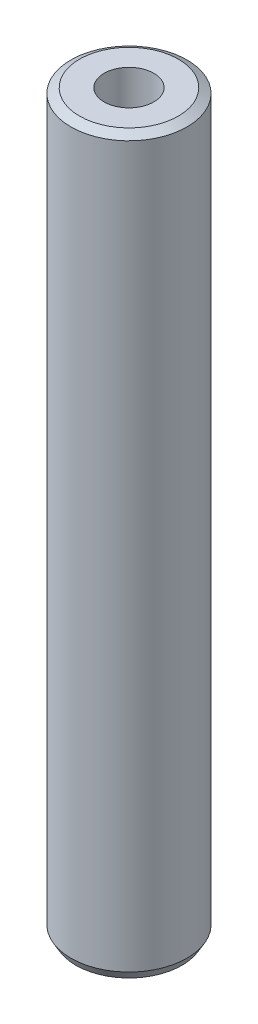
ISO-10303-21;
HEADER;
FILE_DESCRIPTION(('STEP AP214'),'2;1');
FILE_NAME('part.step','',(''),(''),'','','');
FILE_SCHEMA(('AUTOMOTIVE_DESIGN { 1 0 10303 214 1 1 1 1 }'));
ENDSEC;
DATA;
#1=APPLICATION_CONTEXT('core data for automotive mechanical design processes');
#2=APPLICATION_PROTOCOL_DEFINITION('international standard','automotive_design',2000,#1);
#3=PRODUCT_CONTEXT('',#1,'mechanical');
#4=PRODUCT('Part','Part','',(#3));
#5=PRODUCT_RELATED_PRODUCT_CATEGORY('part','',(#4));
#6=PRODUCT_DEFINITION_FORMATION('','',#4);
#7=PRODUCT_DEFINITION_CONTEXT('part definition',#1,'design');
#8=PRODUCT_DEFINITION('design','',#6,#7);
#9=PRODUCT_DEFINITION_SHAPE('','',#8);
#10=(LENGTH_UNIT() NAMED_UNIT(*) SI_UNIT(.MILLI.,.METRE.));
#11=(NAMED_UNIT(*) PLANE_ANGLE_UNIT() SI_UNIT($,.RADIAN.));
#12=(NAMED_UNIT(*) SI_UNIT($,.STERADIAN.) SOLID_ANGLE_UNIT());
#13=UNCERTAINTY_MEASURE_WITH_UNIT(LENGTH_MEASURE(1.E-05),#10,'distance_accuracy_value','');
#14=(GEOMETRIC_REPRESENTATION_CONTEXT(3) GLOBAL_UNCERTAINTY_ASSIGNED_CONTEXT((#13)) GLOBAL_UNIT_ASSIGNED_CONTEXT((#10,
#11,#12)) REPRESENTATION_CONTEXT('',''));
#15=CARTESIAN_POINT('',(0.,0.,0.));
#16=DIRECTION('',(0.,0.,1.));
#17=DIRECTION('',(1.,0.,0.));
#18=AXIS2_PLACEMENT_3D('',#15,#16,#17);
#19=CARTESIAN_POINT('',(0.,600.,0.));
#20=DIRECTION('',(0.,-1.,0.));
#21=DIRECTION('',(0.,0.,-1.));
#22=AXIS2_PLACEMENT_3D('',#19,#20,#21);
#23=CYLINDRICAL_SURFACE('',#22,47.5);
#24=CARTESIAN_POINT('',(0.,595.890190263155,0.));
#25=DIRECTION('',(0.,1.,0.));
#26=DIRECTION('',(0.,0.,1.));
#27=AXIS2_PLACEMENT_3D('',#24,#25,#26);
#28=CIRCLE('',#27,47.5);
#29=CARTESIAN_POINT('',(0.,595.890190263155,47.5));
#30=VERTEX_POINT('',#29);
#31=EDGE_CURVE('E50',#30,#30,#28,.F.);
#32=ORIENTED_EDGE('',*,*,#31,.T.);
#33=EDGE_LOOP('',(#32));
#34=FACE_BOUND('',#33,.T.);
#35=CARTESIAN_POINT('',(0.,7.1183992736561,0.));
#36=DIRECTION('',(0.,1.,0.));
#37=DIRECTION('',(0.,0.,1.));
#38=AXIS2_PLACEMENT_3D('',#35,#36,#37);
#39=CIRCLE('',#38,47.5);
#40=CARTESIAN_POINT('',(0.,7.1183992736561,47.5));
#41=VERTEX_POINT('',#40);
#42=EDGE_CURVE('E51',#41,#41,#39,.T.);
#43=ORIENTED_EDGE('',*,*,#42,.T.);
#44=EDGE_LOOP('',(#43));
#45=FACE_BOUND('',#44,.T.);
#46=ADVANCED_FACE('F39',(#34,#45),#23,.T.);
#47=CARTESIAN_POINT('',(0.,600.,0.));
#48=DIRECTION('',(0.,1.,0.));
#49=DIRECTION('',(0.,0.,1.));
#50=AXIS2_PLACEMENT_3D('',#47,#48,#49);
#51=PLANE('',#50);
#52=CARTESIAN_POINT('',(0.,600.,0.));
#53=DIRECTION('',(0.,1.,0.));
#54=DIRECTION('',(0.,0.,1.));
#55=AXIS2_PLACEMENT_3D('',#52,#53,#54);
#56=CIRCLE('',#55,40.3816007263438);
#57=CARTESIAN_POINT('',(0.,600.,40.3816007263438));
#58=VERTEX_POINT('',#57);
#59=EDGE_CURVE('E54',#58,#58,#56,.T.);
#60=ORIENTED_EDGE('',*,*,#59,.T.);
#61=EDGE_LOOP('',(#60));
#62=FACE_BOUND('',#61,.T.);
#63=CARTESIAN_POINT('',(0.,600.,0.));
#64=DIRECTION('',(0.,1.,0.));
#65=DIRECTION('',(0.,0.,1.));
#66=AXIS2_PLACEMENT_3D('',#63,#64,#65);
#67=CIRCLE('',#66,20.3369692899066);
#68=CARTESIAN_POINT('',(0.,600.,20.3369692899066));
#69=VERTEX_POINT('',#68);
#70=EDGE_CURVE('E58',#69,#69,#67,.T.);
#71=ORIENTED_EDGE('',*,*,#70,.F.);
#72=EDGE_LOOP('',(#71));
#73=FACE_BOUND('',#72,.T.);
#74=ADVANCED_FACE('F69',(#62,#73),#51,.T.);
#75=CARTESIAN_POINT('',(0.,0.,0.));
#76=DIRECTION('',(0.,1.,0.));
#77=DIRECTION('',(0.,0.,1.));
#78=AXIS2_PLACEMENT_3D('',#75,#76,#77);
#79=PLANE('',#78);
#80=CARTESIAN_POINT('',(0.,0.,0.));
#81=DIRECTION('',(0.,1.,0.));
#82=DIRECTION('',(0.,0.,1.));
#83=AXIS2_PLACEMENT_3D('',#80,#81,#82);
#84=CIRCLE('',#83,43.3901902631553);
#85=CARTESIAN_POINT('',(0.,0.,43.3901902631553));
#86=VERTEX_POINT('',#85);
#87=EDGE_CURVE('E10',#86,#86,#84,.F.);
#88=ORIENTED_EDGE('',*,*,#87,.T.);
#89=EDGE_LOOP('',(#88));
#90=FACE_BOUND('',#89,.T.);
#91=CARTESIAN_POINT('',(0.,0.,0.));
#92=DIRECTION('',(0.,1.,0.));
#93=DIRECTION('',(0.,0.,1.));
#94=AXIS2_PLACEMENT_3D('',#91,#92,#93);
#95=CIRCLE('',#94,20.3369692899066);
#96=CARTESIAN_POINT('',(0.,0.,20.3369692899066));
#97=VERTEX_POINT('',#96);
#98=EDGE_CURVE('E63',#97,#97,#95,.T.);
#99=ORIENTED_EDGE('',*,*,#98,.T.);
#100=EDGE_LOOP('',(#99));
#101=FACE_BOUND('',#100,.T.);
#102=ADVANCED_FACE('F75',(#90,#101),#79,.F.);
#103=CARTESIAN_POINT('',(0.,600.,0.));
#104=DIRECTION('',(0.,-1.,0.));
#105=DIRECTION('',(0.,0.,-1.));
#106=AXIS2_PLACEMENT_3D('',#103,#104,#105);
#107=CYLINDRICAL_SURFACE('',#106,20.3369692899066);
#108=ORIENTED_EDGE('',*,*,#70,.T.);
#109=EDGE_LOOP('',(#108));
#110=FACE_BOUND('',#109,.T.);
#111=ORIENTED_EDGE('',*,*,#98,.F.);
#112=EDGE_LOOP('',(#111));
#113=FACE_BOUND('',#112,.T.);
#114=ADVANCED_FACE('F70',(#110,#113),#107,.F.);
#115=CARTESIAN_POINT('',(0.,600.,0.));
#116=DIRECTION('',(0.,-1.,0.));
#117=DIRECTION('',(0.,0.,-1.));
#118=AXIS2_PLACEMENT_3D('',#115,#116,#117);
#119=CONICAL_SURFACE('',#118,40.3816007263438,1.04719755119659);
#120=ORIENTED_EDGE('',*,*,#31,.F.);
#121=EDGE_LOOP('',(#120));
#122=FACE_BOUND('',#121,.T.);
#123=ORIENTED_EDGE('',*,*,#59,.F.);
#124=EDGE_LOOP('',(#123));
#125=FACE_BOUND('',#124,.T.);
#126=ADVANCED_FACE('F81',(#122,#125),#119,.T.);
#127=CARTESIAN_POINT('',(0.,7.1183992736561,0.));
#128=DIRECTION('',(0.,1.,0.));
#129=DIRECTION('',(0.,0.,1.));
#130=AXIS2_PLACEMENT_3D('',#127,#128,#129);
#131=CONICAL_SURFACE('',#130,47.5,0.523598775598309);
#132=CARTESIAN_POINT('',(0.,0.,43.3901902631553));
#133=CARTESIAN_POINT('',(0.,0.0741499924339161,43.4330007812475));
#134=CARTESIAN_POINT('',(0.,0.148299984867834,43.4758112993396));
#135=CARTESIAN_POINT('',(0.,0.29659996973567,43.5614323355238));
#136=CARTESIAN_POINT('',(0.,0.370749962169588,43.604242853616));
#137=CARTESIAN_POINT('',(0.,0.519049947037423,43.6898638898003));
#138=CARTESIAN_POINT('',(0.,0.59319993947134,43.7326744078924));
#139=CARTESIAN_POINT('',(0.,0.741499924339175,43.8182954440766));
#140=CARTESIAN_POINT('',(0.,0.815649916773094,43.8611059621688));
#141=CARTESIAN_POINT('',(0.,0.963949901640929,43.946726998353));
#142=CARTESIAN_POINT('',(0.,1.03809989407485,43.9895375164452));
#143=CARTESIAN_POINT('',(0.,1.18639987894268,44.0751585526294));
#144=CARTESIAN_POINT('',(0.,1.2605498713766,44.1179690707216));
#145=CARTESIAN_POINT('',(0.,1.40884985624443,44.2035901069058));
#146=CARTESIAN_POINT('',(0.,1.48299984867835,44.246400624998));
#147=CARTESIAN_POINT('',(0.,1.63129983354619,44.3320216611822));
#148=CARTESIAN_POINT('',(0.,1.7054498259801,44.3748321792744));
#149=CARTESIAN_POINT('',(0.,1.85374981084794,44.4604532154586));
#150=CARTESIAN_POINT('',(0.,1.92789980328186,44.5032637335508));
#151=CARTESIAN_POINT('',(0.,2.07619978814969,44.588884769735));
#152=CARTESIAN_POINT('',(0.,2.15034978058361,44.6316952878271));
#153=CARTESIAN_POINT('',(0.,2.29864976545145,44.7173163240114));
#154=CARTESIAN_POINT('',(0.,2.37279975788536,44.7601268421036));
#155=CARTESIAN_POINT('',(0.,2.5210997427532,44.8457478782878));
#156=CARTESIAN_POINT('',(0.,2.59524973518712,44.8885583963799));
#157=CARTESIAN_POINT('',(0.,2.74354972005495,44.9741794325642));
#158=CARTESIAN_POINT('',(0.,2.81769971248887,45.0169899506563));
#159=CARTESIAN_POINT('',(0.,2.96599969735671,45.1026109868406));
#160=CARTESIAN_POINT('',(0.,3.04014968979062,45.1454215049327));
#161=CARTESIAN_POINT('',(0.,3.18844967465846,45.231042541117));
#162=CARTESIAN_POINT('',(0.,3.26259966709238,45.2738530592091));
#163=CARTESIAN_POINT('',(0.,3.41089965196021,45.3594740953934));
#164=CARTESIAN_POINT('',(0.,3.48504964439413,45.4022846134855));
#165=CARTESIAN_POINT('',(0.,3.63334962926197,45.4879056496698));
#166=CARTESIAN_POINT('',(0.,3.70749962169588,45.5307161677619));
#167=CARTESIAN_POINT('',(0.,3.85579960656372,45.6163372039462));
#168=CARTESIAN_POINT('',(0.,3.92994959899764,45.6591477220383));
#169=CARTESIAN_POINT('',(0.,4.07824958386547,45.7447687582226));
#170=CARTESIAN_POINT('',(0.,4.15239957629939,45.7875792763147));
#171=CARTESIAN_POINT('',(0.,4.30069956116722,45.873200312499));
#172=CARTESIAN_POINT('',(0.,4.37484955360114,45.9160108305911));
#173=CARTESIAN_POINT('',(0.,4.52314953846898,46.0016318667754));
#174=CARTESIAN_POINT('',(0.,4.59729953090289,46.0444423848675));
#175=CARTESIAN_POINT('',(0.,4.74559951577073,46.1300634210518));
#176=CARTESIAN_POINT('',(0.,4.81974950820465,46.1728739391439));
#177=CARTESIAN_POINT('',(0.,4.96804949307248,46.2584949753282));
#178=CARTESIAN_POINT('',(0.,5.0421994855064,46.3013054934203));
#179=CARTESIAN_POINT('',(0.,5.19049947037424,46.3869265296046));
#180=CARTESIAN_POINT('',(0.,5.26464946280815,46.4297370476967));
#181=CARTESIAN_POINT('',(0.,5.41294944767599,46.515358083881));
#182=CARTESIAN_POINT('',(0.,5.48709944010991,46.5581686019731));
#183=CARTESIAN_POINT('',(0.,5.63539942497774,46.6437896381574));
#184=CARTESIAN_POINT('',(0.,5.70954941741166,46.6866001562495));
#185=CARTESIAN_POINT('',(0.,5.85784940227949,46.7722211924338));
#186=CARTESIAN_POINT('',(0.,5.93199939471341,46.8150317105259));
#187=CARTESIAN_POINT('',(0.,6.08029937958125,46.9006527467102));
#188=CARTESIAN_POINT('',(0.,6.15444937201517,46.9434632648023));
#189=CARTESIAN_POINT('',(0.,6.302749356883,47.0290843009866));
#190=CARTESIAN_POINT('',(0.,6.37689934931692,47.0718948190787));
#191=CARTESIAN_POINT('',(0.,6.52519933418475,47.157515855263));
#192=CARTESIAN_POINT('',(0.,6.59934932661867,47.2003263733551));
#193=CARTESIAN_POINT('',(0.,6.74764931148651,47.2859474095393));
#194=CARTESIAN_POINT('',(0.,6.82179930392042,47.3287579276315));
#195=CARTESIAN_POINT('',(0.,6.97009928878826,47.4143789638158));
#196=CARTESIAN_POINT('',(0.,7.04424928122218,47.4571894819079));
#197=CARTESIAN_POINT('',(0.,7.1183992736561,47.5));
#198=B_SPLINE_CURVE_WITH_KNOTS('',3,(#132,#133,#134,#135,#136,#137,#138,#139,#140,#141,#142,
#143,#144,#145,#146,#147,#148,#149,#150,#151,#152,#153,#154,#155,#156,#157,#158,#159,#160,#161,
#162,#163,#164,#165,#166,#167,#168,#169,#170,#171,#172,#173,#174,#175,#176,#177,#178,#179,#180,
#181,#182,#183,#184,#185,#186,#187,#188,#189,#190,#191,#192,#193,#194,#195,#196,#197),
.UNSPECIFIED.,.F.,.F.,(4,2,2,2,2,2,2,2,2,2,2,2,2,2,2,2,2,2,2,2,2,2,2,2,2,2,2,2,2,2,2,2,4),(0.,
0.256863108552787,0.513726217105574,0.770589325658364,1.02745243421115,1.28431554276394,
1.54117865131673,1.79804175986951,2.0549048684223,2.31176797697509,2.56863108552788,
2.82549419408067,3.08235730263346,3.33922041118624,3.59608351973903,3.85294662829182,
4.10980973684461,4.3666728453974,4.62353595395018,4.88039906250297,5.13726217105576,
5.39412527960855,5.65098838816134,5.90785149671413,6.16471460526691,6.4215777138197,
6.67844082237249,6.93530393092528,7.19216703947807,7.44903014803085,7.70589325658364,
7.96275636513643,8.21961947368922),.UNSPECIFIED.);
#199=EDGE_CURVE('BSEAM45',#86,#41,#198,.T.);
#200=ORIENTED_EDGE('',*,*,#87,.F.);
#201=ORIENTED_EDGE('',*,*,#42,.F.);
#202=ORIENTED_EDGE('',*,*,#199,.T.);
#203=ORIENTED_EDGE('',*,*,#199,.F.);
#204=EDGE_LOOP('',(#200,#202,#201,#203));
#205=FACE_BOUND('',#204,.T.);
#206=ADVANCED_FACE('F45',(#205),#131,.T.);
#207=CLOSED_SHELL('',(#46,#74,#102,#114,#126,#206));
#208=MANIFOLD_SOLID_BREP('B2',#207);
#209=ADVANCED_BREP_SHAPE_REPRESENTATION('',(#18,#208),#14);
#210=SHAPE_DEFINITION_REPRESENTATION(#9,#209);
ENDSEC;
END-ISO-10303-21;
